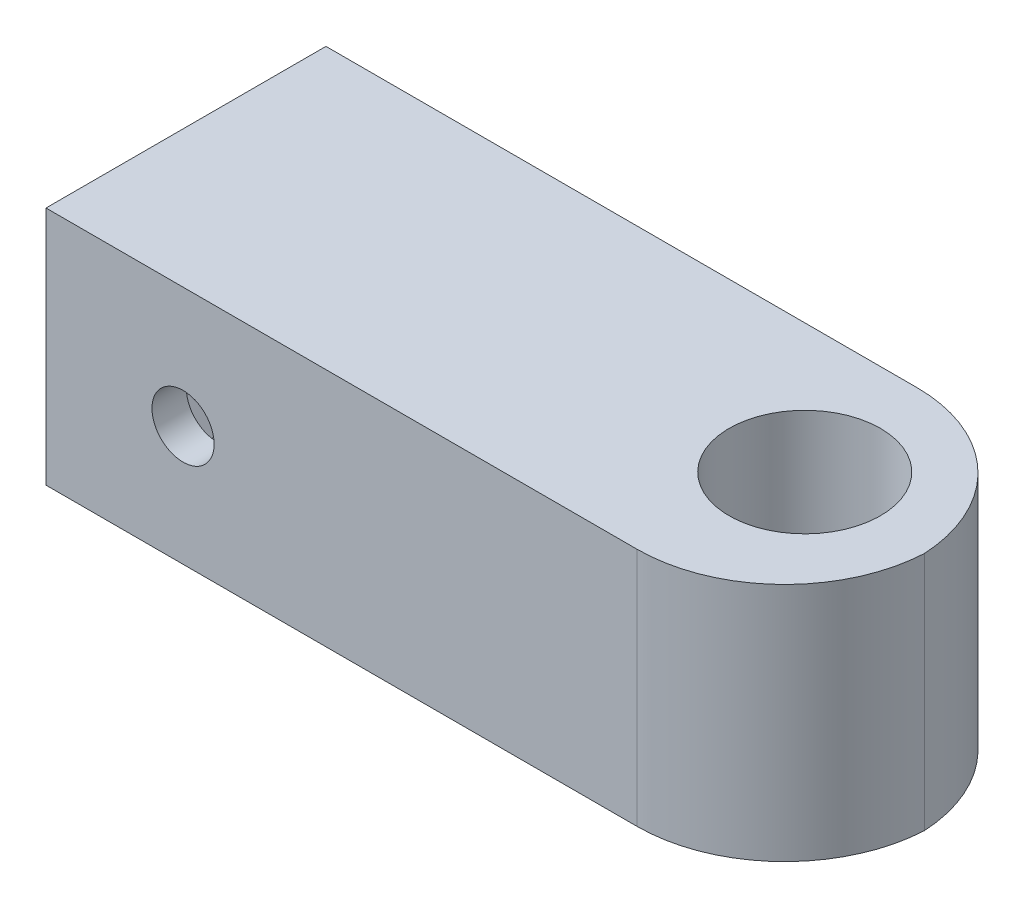
ISO-10303-21;
HEADER;
FILE_DESCRIPTION(('STEP AP214'),'2;1');
FILE_NAME('part.step','',(''),(''),'','','');
FILE_SCHEMA(('AUTOMOTIVE_DESIGN { 1 0 10303 214 1 1 1 1 }'));
ENDSEC;
DATA;
#1=APPLICATION_CONTEXT('core data for automotive mechanical design processes');
#2=APPLICATION_PROTOCOL_DEFINITION('international standard','automotive_design',2000,#1);
#3=PRODUCT_CONTEXT('',#1,'mechanical');
#4=PRODUCT('Part','Part','',(#3));
#5=PRODUCT_RELATED_PRODUCT_CATEGORY('part','',(#4));
#6=PRODUCT_DEFINITION_FORMATION('','',#4);
#7=PRODUCT_DEFINITION_CONTEXT('part definition',#1,'design');
#8=PRODUCT_DEFINITION('design','',#6,#7);
#9=PRODUCT_DEFINITION_SHAPE('','',#8);
#10=(LENGTH_UNIT() NAMED_UNIT(*) SI_UNIT(.MILLI.,.METRE.));
#11=(NAMED_UNIT(*) PLANE_ANGLE_UNIT() SI_UNIT($,.RADIAN.));
#12=(NAMED_UNIT(*) SI_UNIT($,.STERADIAN.) SOLID_ANGLE_UNIT());
#13=UNCERTAINTY_MEASURE_WITH_UNIT(LENGTH_MEASURE(1.E-05),#10,'distance_accuracy_value','');
#14=(GEOMETRIC_REPRESENTATION_CONTEXT(3) GLOBAL_UNCERTAINTY_ASSIGNED_CONTEXT((#13)) GLOBAL_UNIT_ASSIGNED_CONTEXT((#10,
#11,#12)) REPRESENTATION_CONTEXT('',''));
#15=CARTESIAN_POINT('',(0.,0.,0.));
#16=DIRECTION('',(0.,0.,1.));
#17=DIRECTION('',(1.,0.,0.));
#18=AXIS2_PLACEMENT_3D('',#15,#16,#17);
#19=CARTESIAN_POINT('',(0.,13.,0.));
#20=DIRECTION('',(0.,1.,0.));
#21=DIRECTION('',(0.,0.,1.));
#22=AXIS2_PLACEMENT_3D('',#19,#20,#21);
#23=PLANE('',#22);
#24=CARTESIAN_POINT('',(12.,13.,0.161034979478818));
#25=DIRECTION('',(0.,1.,0.));
#26=DIRECTION('',(0.,0.,1.));
#27=AXIS2_PLACEMENT_3D('',#24,#25,#26);
#28=CIRCLE('',#27,8.);
#29=CARTESIAN_POINT('',(12.,13.,8.16103497947882));
#30=VERTEX_POINT('',#29);
#31=CARTESIAN_POINT('',(19.9889945815219,13.,0.580517489739392));
#32=VERTEX_POINT('',#31);
#33=EDGE_CURVE('E52',#30,#32,#28,.T.);
#34=ORIENTED_EDGE('',*,*,#33,.T.);
#35=CARTESIAN_POINT('',(12.,13.,0.999999999999999));
#36=DIRECTION('',(0.,1.,0.));
#37=DIRECTION('',(0.,0.,1.));
#38=AXIS2_PLACEMENT_3D('',#35,#36,#37);
#39=CIRCLE('',#38,8.);
#40=CARTESIAN_POINT('',(12.,13.,-7.));
#41=VERTEX_POINT('',#40);
#42=EDGE_CURVE('E45',#32,#41,#39,.T.);
#43=ORIENTED_EDGE('',*,*,#42,.T.);
#44=DIRECTION('',(-1.,0.,0.));
#45=VECTOR('',#44,1.);
#46=CARTESIAN_POINT('',(20.,13.,-7.));
#47=LINE('',#46,#45);
#48=CARTESIAN_POINT('',(-20.,13.,-7.));
#49=VERTEX_POINT('',#48);
#50=EDGE_CURVE('E244',#41,#49,#47,.T.);
#51=ORIENTED_EDGE('',*,*,#50,.T.);
#52=DIRECTION('',(0.,0.,1.));
#53=VECTOR('',#52,1.);
#54=CARTESIAN_POINT('',(-20.,13.,5.));
#55=LINE('',#54,#53);
#56=CARTESIAN_POINT('',(-20.,13.,8.16103497947882));
#57=VERTEX_POINT('',#56);
#58=EDGE_CURVE('E246',#49,#57,#55,.T.);
#59=ORIENTED_EDGE('',*,*,#58,.T.);
#60=DIRECTION('',(1.,0.,0.));
#61=VECTOR('',#60,1.);
#62=CARTESIAN_POINT('',(-20.,13.,8.16103497947882));
#63=LINE('',#62,#61);
#64=EDGE_CURVE('E249',#57,#30,#63,.T.);
#65=ORIENTED_EDGE('',*,*,#64,.T.);
#66=EDGE_LOOP('',(#34,#43,#51,#59,#65));
#67=FACE_BOUND('',#66,.T.);
#68=CARTESIAN_POINT('',(12.9305740964565,13.,0.));
#69=DIRECTION('',(0.,1.,0.));
#70=DIRECTION('',(0.,0.,1.));
#71=AXIS2_PLACEMENT_3D('',#68,#69,#70);
#72=CIRCLE('',#71,4.1);
#73=CARTESIAN_POINT('',(12.9305740964565,13.,-4.1));
#74=VERTEX_POINT('',#73);
#75=EDGE_CURVE('E238',#74,#74,#72,.T.);
#76=ORIENTED_EDGE('',*,*,#75,.F.);
#77=EDGE_LOOP('',(#76));
#78=FACE_BOUND('',#77,.T.);
#79=ADVANCED_FACE('F36',(#67,#78),#23,.T.);
#80=CARTESIAN_POINT('',(0.,0.,0.));
#81=DIRECTION('',(0.,1.,0.));
#82=DIRECTION('',(0.,0.,1.));
#83=AXIS2_PLACEMENT_3D('',#80,#81,#82);
#84=PLANE('',#83);
#85=DIRECTION('',(-1.,0.,0.));
#86=VECTOR('',#85,1.);
#87=CARTESIAN_POINT('',(20.,0.,-7.));
#88=LINE('',#87,#86);
#89=CARTESIAN_POINT('',(12.,0.,-7.));
#90=VERTEX_POINT('',#89);
#91=CARTESIAN_POINT('',(-20.,0.,-7.));
#92=VERTEX_POINT('',#91);
#93=EDGE_CURVE('E241',#90,#92,#88,.T.);
#94=ORIENTED_EDGE('',*,*,#93,.F.);
#95=CARTESIAN_POINT('',(12.,0.,0.999999999999999));
#96=DIRECTION('',(0.,1.,0.));
#97=DIRECTION('',(0.,0.,1.));
#98=AXIS2_PLACEMENT_3D('',#95,#96,#97);
#99=CIRCLE('',#98,8.);
#100=CARTESIAN_POINT('',(19.9889945815219,0.,0.580517489739392));
#101=VERTEX_POINT('',#100);
#102=EDGE_CURVE('E266',#90,#101,#99,.F.);
#103=ORIENTED_EDGE('',*,*,#102,.T.);
#104=CARTESIAN_POINT('',(12.,0.,0.161034979478818));
#105=DIRECTION('',(0.,1.,0.));
#106=DIRECTION('',(0.,0.,1.));
#107=AXIS2_PLACEMENT_3D('',#104,#105,#106);
#108=CIRCLE('',#107,8.);
#109=CARTESIAN_POINT('',(12.,0.,8.16103497947882));
#110=VERTEX_POINT('',#109);
#111=EDGE_CURVE('E264',#101,#110,#108,.F.);
#112=ORIENTED_EDGE('',*,*,#111,.T.);
#113=DIRECTION('',(1.,0.,0.));
#114=VECTOR('',#113,1.);
#115=CARTESIAN_POINT('',(-20.,0.,8.16103497947882));
#116=LINE('',#115,#114);
#117=CARTESIAN_POINT('',(-20.,0.,8.16103497947882));
#118=VERTEX_POINT('',#117);
#119=EDGE_CURVE('E247',#118,#110,#116,.T.);
#120=ORIENTED_EDGE('',*,*,#119,.F.);
#121=DIRECTION('',(0.,0.,1.));
#122=VECTOR('',#121,1.);
#123=CARTESIAN_POINT('',(-20.,0.,5.));
#124=LINE('',#123,#122);
#125=EDGE_CURVE('E253',#92,#118,#124,.T.);
#126=ORIENTED_EDGE('',*,*,#125,.F.);
#127=EDGE_LOOP('',(#94,#103,#112,#120,#126));
#128=FACE_BOUND('',#127,.T.);
#129=CARTESIAN_POINT('',(12.9305740964565,0.,0.));
#130=DIRECTION('',(0.,1.,0.));
#131=DIRECTION('',(0.,0.,1.));
#132=AXIS2_PLACEMENT_3D('',#129,#130,#131);
#133=CIRCLE('',#132,4.1);
#134=CARTESIAN_POINT('',(12.9305740964565,0.,-4.1));
#135=VERTEX_POINT('',#134);
#136=EDGE_CURVE('E231',#135,#135,#133,.T.);
#137=ORIENTED_EDGE('',*,*,#136,.T.);
#138=EDGE_LOOP('',(#137));
#139=FACE_BOUND('',#138,.T.);
#140=ADVANCED_FACE('F283',(#128,#139),#84,.F.);
#141=CARTESIAN_POINT('',(20.,13.,-7.));
#142=DIRECTION('',(0.,0.,1.));
#143=DIRECTION('',(1.,0.,0.));
#144=AXIS2_PLACEMENT_3D('',#141,#142,#143);
#145=PLANE('',#144);
#146=ORIENTED_EDGE('',*,*,#50,.F.);
#147=DIRECTION('',(0.,-1.,0.));
#148=VECTOR('',#147,1.);
#149=CARTESIAN_POINT('',(12.,13.,-7.));
#150=LINE('',#149,#148);
#151=EDGE_CURVE('E261',#41,#90,#150,.T.);
#152=ORIENTED_EDGE('',*,*,#151,.T.);
#153=ORIENTED_EDGE('',*,*,#93,.T.);
#154=DIRECTION('',(0.,-1.,0.));
#155=VECTOR('',#154,1.);
#156=CARTESIAN_POINT('',(-20.,13.,-7.));
#157=LINE('',#156,#155);
#158=EDGE_CURVE('E258',#49,#92,#157,.T.);
#159=ORIENTED_EDGE('',*,*,#158,.F.);
#160=EDGE_LOOP('',(#146,#152,#153,#159));
#161=FACE_BOUND('',#160,.T.);
#162=ADVANCED_FACE('F277',(#161),#145,.F.);
#163=CARTESIAN_POINT('',(-20.,13.,5.));
#164=DIRECTION('',(1.,0.,0.));
#165=DIRECTION('',(0.,0.,-1.));
#166=AXIS2_PLACEMENT_3D('',#163,#164,#165);
#167=PLANE('',#166);
#168=DIRECTION('',(0.,0.,1.));
#169=VECTOR('',#168,1.);
#170=CARTESIAN_POINT('',(-20.,3.,3.5));
#171=LINE('',#170,#169);
#172=CARTESIAN_POINT('',(-20.,3.,-3.5));
#173=VERTEX_POINT('',#172);
#174=CARTESIAN_POINT('',(-20.,3.,3.5));
#175=VERTEX_POINT('',#174);
#176=EDGE_CURVE('E221',#173,#175,#171,.T.);
#177=ORIENTED_EDGE('',*,*,#176,.F.);
#178=DIRECTION('',(0.,-1.,0.));
#179=VECTOR('',#178,1.);
#180=CARTESIAN_POINT('',(-20.,3.,-3.5));
#181=LINE('',#180,#179);
#182=CARTESIAN_POINT('',(-20.,10.,-3.5));
#183=VERTEX_POINT('',#182);
#184=EDGE_CURVE('E198',#183,#173,#181,.T.);
#185=ORIENTED_EDGE('',*,*,#184,.F.);
#186=DIRECTION('',(0.,0.,-1.));
#187=VECTOR('',#186,1.);
#188=CARTESIAN_POINT('',(-20.,10.,3.5));
#189=LINE('',#188,#187);
#190=CARTESIAN_POINT('',(-20.,10.,3.5));
#191=VERTEX_POINT('',#190);
#192=EDGE_CURVE('E210',#191,#183,#189,.T.);
#193=ORIENTED_EDGE('',*,*,#192,.F.);
#194=DIRECTION('',(0.,1.,0.));
#195=VECTOR('',#194,1.);
#196=CARTESIAN_POINT('',(-20.,3.,3.5));
#197=LINE('',#196,#195);
#198=EDGE_CURVE('E224',#175,#191,#197,.T.);
#199=ORIENTED_EDGE('',*,*,#198,.F.);
#200=EDGE_LOOP('',(#177,#185,#193,#199));
#201=FACE_BOUND('',#200,.T.);
#202=ORIENTED_EDGE('',*,*,#125,.T.);
#203=DIRECTION('',(0.,-1.,0.));
#204=VECTOR('',#203,1.);
#205=CARTESIAN_POINT('',(-20.,13.,8.16103497947882));
#206=LINE('',#205,#204);
#207=EDGE_CURVE('E251',#57,#118,#206,.T.);
#208=ORIENTED_EDGE('',*,*,#207,.F.);
#209=ORIENTED_EDGE('',*,*,#58,.F.);
#210=ORIENTED_EDGE('',*,*,#158,.T.);
#211=EDGE_LOOP('',(#202,#208,#209,#210));
#212=FACE_BOUND('',#211,.T.);
#213=ADVANCED_FACE('F318',(#201,#212),#167,.F.);
#214=CARTESIAN_POINT('',(-20.,13.,8.16103497947882));
#215=DIRECTION('',(0.,0.,-1.));
#216=DIRECTION('',(-1.,0.,0.));
#217=AXIS2_PLACEMENT_3D('',#214,#215,#216);
#218=PLANE('',#217);
#219=CARTESIAN_POINT('',(-12.5774987078967,6.47590517488906,8.16103497947882));
#220=DIRECTION('',(0.,0.,-1.));
#221=DIRECTION('',(-1.,0.,0.));
#222=AXIS2_PLACEMENT_3D('',#219,#220,#221);
#223=CIRCLE('',#222,1.68366195753648);
#224=CARTESIAN_POINT('',(-14.2611606654332,6.47590517488906,8.16103497947882));
#225=VERTEX_POINT('',#224);
#226=EDGE_CURVE('E175',#225,#225,#223,.T.);
#227=ORIENTED_EDGE('',*,*,#226,.T.);
#228=EDGE_LOOP('',(#227));
#229=FACE_BOUND('',#228,.T.);
#230=ORIENTED_EDGE('',*,*,#119,.T.);
#231=DIRECTION('',(0.,-1.,0.));
#232=VECTOR('',#231,1.);
#233=CARTESIAN_POINT('',(12.,13.,8.16103497947882));
#234=LINE('',#233,#232);
#235=EDGE_CURVE('E11',#110,#30,#234,.F.);
#236=ORIENTED_EDGE('',*,*,#235,.T.);
#237=ORIENTED_EDGE('',*,*,#64,.F.);
#238=ORIENTED_EDGE('',*,*,#207,.T.);
#239=EDGE_LOOP('',(#230,#236,#237,#238));
#240=FACE_BOUND('',#239,.T.);
#241=ADVANCED_FACE('F295',(#229,#240),#218,.F.);
#242=CARTESIAN_POINT('',(12.9305740964565,13.,0.));
#243=DIRECTION('',(0.,-1.,0.));
#244=DIRECTION('',(0.,0.,-1.));
#245=AXIS2_PLACEMENT_3D('',#242,#243,#244);
#246=CYLINDRICAL_SURFACE('',#245,4.1);
#247=CARTESIAN_POINT('',(12.9305740964565,13.,-4.1));
#248=CARTESIAN_POINT('',(12.9305740964565,12.8645833333333,-4.1));
#249=CARTESIAN_POINT('',(12.9305740964565,12.7291666666667,-4.1));
#250=CARTESIAN_POINT('',(12.9305740964565,12.4583333333333,-4.1));
#251=CARTESIAN_POINT('',(12.9305740964565,12.3229166666667,-4.1));
#252=CARTESIAN_POINT('',(12.9305740964565,12.0520833333333,-4.1));
#253=CARTESIAN_POINT('',(12.9305740964565,11.9166666666667,-4.1));
#254=CARTESIAN_POINT('',(12.9305740964565,11.6458333333333,-4.1));
#255=CARTESIAN_POINT('',(12.9305740964565,11.5104166666667,-4.1));
#256=CARTESIAN_POINT('',(12.9305740964565,11.2395833333333,-4.1));
#257=CARTESIAN_POINT('',(12.9305740964565,11.1041666666667,-4.1));
#258=CARTESIAN_POINT('',(12.9305740964565,10.8333333333333,-4.1));
#259=CARTESIAN_POINT('',(12.9305740964565,10.6979166666667,-4.1));
#260=CARTESIAN_POINT('',(12.9305740964565,10.4270833333333,-4.1));
#261=CARTESIAN_POINT('',(12.9305740964565,10.2916666666667,-4.1));
#262=CARTESIAN_POINT('',(12.9305740964565,10.0208333333333,-4.1));
#263=CARTESIAN_POINT('',(12.9305740964565,9.88541666666667,-4.1));
#264=CARTESIAN_POINT('',(12.9305740964565,9.61458333333333,-4.1));
#265=CARTESIAN_POINT('',(12.9305740964565,9.47916666666667,-4.1));
#266=CARTESIAN_POINT('',(12.9305740964565,9.20833333333333,-4.1));
#267=CARTESIAN_POINT('',(12.9305740964565,9.07291666666667,-4.1));
#268=CARTESIAN_POINT('',(12.9305740964565,8.80208333333333,-4.1));
#269=CARTESIAN_POINT('',(12.9305740964565,8.66666666666667,-4.1));
#270=CARTESIAN_POINT('',(12.9305740964565,8.39583333333333,-4.1));
#271=CARTESIAN_POINT('',(12.9305740964565,8.26041666666667,-4.1));
#272=CARTESIAN_POINT('',(12.9305740964565,7.98958333333333,-4.1));
#273=CARTESIAN_POINT('',(12.9305740964565,7.85416666666667,-4.1));
#274=CARTESIAN_POINT('',(12.9305740964565,7.58333333333333,-4.1));
#275=CARTESIAN_POINT('',(12.9305740964565,7.44791666666667,-4.1));
#276=CARTESIAN_POINT('',(12.9305740964565,7.17708333333333,-4.1));
#277=CARTESIAN_POINT('',(12.9305740964565,7.04166666666667,-4.1));
#278=CARTESIAN_POINT('',(12.9305740964565,6.77083333333333,-4.1));
#279=CARTESIAN_POINT('',(12.9305740964565,6.63541666666667,-4.1));
#280=CARTESIAN_POINT('',(12.9305740964565,6.36458333333333,-4.1));
#281=CARTESIAN_POINT('',(12.9305740964565,6.22916666666667,-4.1));
#282=CARTESIAN_POINT('',(12.9305740964565,5.95833333333333,-4.1));
#283=CARTESIAN_POINT('',(12.9305740964565,5.82291666666667,-4.1));
#284=CARTESIAN_POINT('',(12.9305740964565,5.55208333333333,-4.1));
#285=CARTESIAN_POINT('',(12.9305740964565,5.41666666666667,-4.1));
#286=CARTESIAN_POINT('',(12.9305740964565,5.14583333333333,-4.1));
#287=CARTESIAN_POINT('',(12.9305740964565,5.01041666666667,-4.1));
#288=CARTESIAN_POINT('',(12.9305740964565,4.73958333333333,-4.1));
#289=CARTESIAN_POINT('',(12.9305740964565,4.60416666666667,-4.1));
#290=CARTESIAN_POINT('',(12.9305740964565,4.33333333333333,-4.1));
#291=CARTESIAN_POINT('',(12.9305740964565,4.19791666666667,-4.1));
#292=CARTESIAN_POINT('',(12.9305740964565,3.92708333333333,-4.1));
#293=CARTESIAN_POINT('',(12.9305740964565,3.79166666666667,-4.1));
#294=CARTESIAN_POINT('',(12.9305740964565,3.52083333333333,-4.1));
#295=CARTESIAN_POINT('',(12.9305740964565,3.38541666666667,-4.1));
#296=CARTESIAN_POINT('',(12.9305740964565,3.11458333333333,-4.1));
#297=CARTESIAN_POINT('',(12.9305740964565,2.97916666666667,-4.1));
#298=CARTESIAN_POINT('',(12.9305740964565,2.70833333333333,-4.1));
#299=CARTESIAN_POINT('',(12.9305740964565,2.57291666666667,-4.1));
#300=CARTESIAN_POINT('',(12.9305740964565,2.30208333333333,-4.1));
#301=CARTESIAN_POINT('',(12.9305740964565,2.16666666666667,-4.1));
#302=CARTESIAN_POINT('',(12.9305740964565,1.89583333333333,-4.1));
#303=CARTESIAN_POINT('',(12.9305740964565,1.76041666666667,-4.1));
#304=CARTESIAN_POINT('',(12.9305740964565,1.48958333333333,-4.1));
#305=CARTESIAN_POINT('',(12.9305740964565,1.35416666666667,-4.1));
#306=CARTESIAN_POINT('',(12.9305740964565,1.08333333333333,-4.1));
#307=CARTESIAN_POINT('',(12.9305740964565,0.947916666666667,-4.1));
#308=CARTESIAN_POINT('',(12.9305740964565,0.677083333333334,-4.1));
#309=CARTESIAN_POINT('',(12.9305740964565,0.541666666666667,-4.1));
#310=CARTESIAN_POINT('',(12.9305740964565,0.270833333333334,-4.1));
#311=CARTESIAN_POINT('',(12.9305740964565,0.135416666666667,-4.1));
#312=CARTESIAN_POINT('',(12.9305740964565,0.,-4.1));
#313=B_SPLINE_CURVE_WITH_KNOTS('',3,(#247,#248,#249,#250,#251,#252,#253,#254,#255,#256,#257,
#258,#259,#260,#261,#262,#263,#264,#265,#266,#267,#268,#269,#270,#271,#272,#273,#274,#275,#276,
#277,#278,#279,#280,#281,#282,#283,#284,#285,#286,#287,#288,#289,#290,#291,#292,#293,#294,#295,
#296,#297,#298,#299,#300,#301,#302,#303,#304,#305,#306,#307,#308,#309,#310,#311,#312),
.UNSPECIFIED.,.F.,.F.,(4,2,2,2,2,2,2,2,2,2,2,2,2,2,2,2,2,2,2,2,2,2,2,2,2,2,2,2,2,2,2,2,4),(0.,
0.406249999999999,0.812499999999999,1.21875,1.625,2.03125,2.4375,2.84375,3.25,3.65625,4.0625,
4.46875,4.875,5.28125,5.6875,6.09375,6.5,6.90625,7.3125,7.71875,8.125,8.53125,8.9375,9.34375,
9.75,10.15625,10.5625,10.96875,11.375,11.78125,12.1875,12.59375,13.),.UNSPECIFIED.);
#314=EDGE_CURVE('BSEAM313',#74,#135,#313,.T.);
#315=ORIENTED_EDGE('',*,*,#75,.T.);
#316=ORIENTED_EDGE('',*,*,#136,.F.);
#317=ORIENTED_EDGE('',*,*,#314,.T.);
#318=ORIENTED_EDGE('',*,*,#314,.F.);
#319=EDGE_LOOP('',(#315,#317,#316,#318));
#320=FACE_BOUND('',#319,.T.);
#321=ADVANCED_FACE('F313',(#320),#246,.F.);
#322=CARTESIAN_POINT('',(6.00000000000002,3.,-3.5));
#323=DIRECTION('',(0.,0.,-1.));
#324=DIRECTION('',(-1.,0.,0.));
#325=AXIS2_PLACEMENT_3D('',#322,#323,#324);
#326=PLANE('',#325);
#327=ORIENTED_EDGE('',*,*,#184,.T.);
#328=DIRECTION('',(-1.,0.,0.));
#329=VECTOR('',#328,1.);
#330=CARTESIAN_POINT('',(6.00000000000002,3.,-3.5));
#331=LINE('',#330,#329);
#332=CARTESIAN_POINT('',(6.00000000000002,3.,-3.5));
#333=VERTEX_POINT('',#332);
#334=EDGE_CURVE('E219',#333,#173,#331,.T.);
#335=ORIENTED_EDGE('',*,*,#334,.F.);
#336=DIRECTION('',(0.,-1.,0.));
#337=VECTOR('',#336,1.);
#338=CARTESIAN_POINT('',(6.00000000000002,3.,-3.5));
#339=LINE('',#338,#337);
#340=CARTESIAN_POINT('',(6.00000000000002,10.,-3.5));
#341=VERTEX_POINT('',#340);
#342=EDGE_CURVE('E206',#341,#333,#339,.T.);
#343=ORIENTED_EDGE('',*,*,#342,.F.);
#344=DIRECTION('',(-1.,0.,0.));
#345=VECTOR('',#344,1.);
#346=CARTESIAN_POINT('',(6.00000000000002,10.,-3.5));
#347=LINE('',#346,#345);
#348=EDGE_CURVE('E229',#341,#183,#347,.T.);
#349=ORIENTED_EDGE('',*,*,#348,.T.);
#350=EDGE_LOOP('',(#327,#335,#343,#349));
#351=FACE_BOUND('',#350,.T.);
#352=ADVANCED_FACE('F462',(#351),#326,.F.);
#353=CARTESIAN_POINT('',(6.00000000000002,10.,3.5));
#354=DIRECTION('',(0.,1.,0.));
#355=DIRECTION('',(0.,0.,1.));
#356=AXIS2_PLACEMENT_3D('',#353,#354,#355);
#357=PLANE('',#356);
#358=ORIENTED_EDGE('',*,*,#192,.T.);
#359=ORIENTED_EDGE('',*,*,#348,.F.);
#360=DIRECTION('',(0.,0.,-1.));
#361=VECTOR('',#360,1.);
#362=CARTESIAN_POINT('',(6.00000000000002,10.,3.5));
#363=LINE('',#362,#361);
#364=CARTESIAN_POINT('',(6.00000000000002,10.,3.5));
#365=VERTEX_POINT('',#364);
#366=EDGE_CURVE('E216',#365,#341,#363,.T.);
#367=ORIENTED_EDGE('',*,*,#366,.F.);
#368=DIRECTION('',(-1.,0.,0.));
#369=VECTOR('',#368,1.);
#370=CARTESIAN_POINT('',(6.00000000000002,10.,3.5));
#371=LINE('',#370,#369);
#372=EDGE_CURVE('E232',#365,#191,#371,.T.);
#373=ORIENTED_EDGE('',*,*,#372,.T.);
#374=EDGE_LOOP('',(#358,#359,#367,#373));
#375=FACE_BOUND('',#374,.T.);
#376=ADVANCED_FACE('F436',(#375),#357,.F.);
#377=CARTESIAN_POINT('',(6.00000000000002,3.,3.5));
#378=DIRECTION('',(0.,0.,1.));
#379=DIRECTION('',(1.,0.,0.));
#380=AXIS2_PLACEMENT_3D('',#377,#378,#379);
#381=PLANE('',#380);
#382=DIRECTION('',(-0.499999999999998,-0.86602540378444,0.));
#383=VECTOR('',#382,1.);
#384=CARTESIAN_POINT('',(-8.88245698508306,6.47590517488908,3.5));
#385=LINE('',#384,#383);
#386=CARTESIAN_POINT('',(-8.88245698508306,6.47590517488908,3.5));
#387=VERTEX_POINT('',#386);
#388=CARTESIAN_POINT('',(-10.7299778464899,3.27590517488907,3.5));
#389=VERTEX_POINT('',#388);
#390=EDGE_CURVE('E186',#387,#389,#385,.T.);
#391=ORIENTED_EDGE('',*,*,#390,.F.);
#392=DIRECTION('',(0.500000000000002,-0.866025403784438,0.));
#393=VECTOR('',#392,1.);
#394=CARTESIAN_POINT('',(-10.7299778464899,9.67590517488908,3.5));
#395=LINE('',#394,#393);
#396=CARTESIAN_POINT('',(-10.7299778464899,9.67590517488908,3.5));
#397=VERTEX_POINT('',#396);
#398=EDGE_CURVE('E151',#397,#387,#395,.T.);
#399=ORIENTED_EDGE('',*,*,#398,.F.);
#400=DIRECTION('',(1.,0.,0.));
#401=VECTOR('',#400,1.);
#402=CARTESIAN_POINT('',(-14.4250195693035,9.67590517488907,3.5));
#403=LINE('',#402,#401);
#404=CARTESIAN_POINT('',(-14.4250195693035,9.67590517488907,3.5));
#405=VERTEX_POINT('',#404);
#406=EDGE_CURVE('E169',#405,#397,#403,.T.);
#407=ORIENTED_EDGE('',*,*,#406,.F.);
#408=DIRECTION('',(0.499999999999997,0.86602540378444,0.));
#409=VECTOR('',#408,1.);
#410=CARTESIAN_POINT('',(-16.2725404307103,6.47590517488906,3.5));
#411=LINE('',#410,#409);
#412=CARTESIAN_POINT('',(-16.2725404307103,6.47590517488906,3.5));
#413=VERTEX_POINT('',#412);
#414=EDGE_CURVE('E172',#413,#405,#411,.T.);
#415=ORIENTED_EDGE('',*,*,#414,.F.);
#416=DIRECTION('',(-0.500000000000002,0.866025403784438,0.));
#417=VECTOR('',#416,1.);
#418=CARTESIAN_POINT('',(-14.4250195693035,3.27590517488906,3.5));
#419=LINE('',#418,#417);
#420=CARTESIAN_POINT('',(-14.4250195693035,3.27590517488906,3.5));
#421=VERTEX_POINT('',#420);
#422=EDGE_CURVE('E191',#421,#413,#419,.T.);
#423=ORIENTED_EDGE('',*,*,#422,.F.);
#424=DIRECTION('',(-1.,0.,0.));
#425=VECTOR('',#424,1.);
#426=CARTESIAN_POINT('',(-10.7299778464899,3.27590517488907,3.5));
#427=LINE('',#426,#425);
#428=EDGE_CURVE('E188',#389,#421,#427,.T.);
#429=ORIENTED_EDGE('',*,*,#428,.F.);
#430=EDGE_LOOP('',(#391,#399,#407,#415,#423,#429));
#431=FACE_BOUND('',#430,.T.);
#432=ORIENTED_EDGE('',*,*,#198,.T.);
#433=ORIENTED_EDGE('',*,*,#372,.F.);
#434=DIRECTION('',(0.,1.,0.));
#435=VECTOR('',#434,1.);
#436=CARTESIAN_POINT('',(6.00000000000002,3.,3.5));
#437=LINE('',#436,#435);
#438=CARTESIAN_POINT('',(6.00000000000002,3.,3.5));
#439=VERTEX_POINT('',#438);
#440=EDGE_CURVE('E213',#439,#365,#437,.T.);
#441=ORIENTED_EDGE('',*,*,#440,.F.);
#442=DIRECTION('',(-1.,0.,0.));
#443=VECTOR('',#442,1.);
#444=CARTESIAN_POINT('',(6.00000000000002,3.,3.5));
#445=LINE('',#444,#443);
#446=EDGE_CURVE('E234',#439,#175,#445,.T.);
#447=ORIENTED_EDGE('',*,*,#446,.T.);
#448=EDGE_LOOP('',(#432,#433,#441,#447));
#449=FACE_BOUND('',#448,.T.);
#450=ADVANCED_FACE('F430',(#431,#449),#381,.F.);
#451=CARTESIAN_POINT('',(6.00000000000002,3.,3.5));
#452=DIRECTION('',(0.,-1.,0.));
#453=DIRECTION('',(0.,0.,-1.));
#454=AXIS2_PLACEMENT_3D('',#451,#452,#453);
#455=PLANE('',#454);
#456=ORIENTED_EDGE('',*,*,#176,.T.);
#457=ORIENTED_EDGE('',*,*,#446,.F.);
#458=DIRECTION('',(0.,0.,1.));
#459=VECTOR('',#458,1.);
#460=CARTESIAN_POINT('',(6.00000000000002,3.,3.5));
#461=LINE('',#460,#459);
#462=EDGE_CURVE('E209',#333,#439,#461,.T.);
#463=ORIENTED_EDGE('',*,*,#462,.F.);
#464=ORIENTED_EDGE('',*,*,#334,.T.);
#465=EDGE_LOOP('',(#456,#457,#463,#464));
#466=FACE_BOUND('',#465,.T.);
#467=ADVANCED_FACE('F435',(#466),#455,.F.);
#468=CARTESIAN_POINT('',(6.00000000000002,0.,0.));
#469=DIRECTION('',(-1.,0.,0.));
#470=DIRECTION('',(0.,0.,1.));
#471=AXIS2_PLACEMENT_3D('',#468,#469,#470);
#472=PLANE('',#471);
#473=ORIENTED_EDGE('',*,*,#342,.T.);
#474=ORIENTED_EDGE('',*,*,#462,.T.);
#475=ORIENTED_EDGE('',*,*,#440,.T.);
#476=ORIENTED_EDGE('',*,*,#366,.T.);
#477=EDGE_LOOP('',(#473,#474,#475,#476));
#478=FACE_BOUND('',#477,.T.);
#479=ADVANCED_FACE('F423',(#478),#472,.T.);
#480=CARTESIAN_POINT('',(-10.7299778464899,9.67590517488908,6.3));
#481=DIRECTION('',(0.866025403784438,0.500000000000002,0.));
#482=DIRECTION('',(-0.500000000000002,0.866025403784438,0.));
#483=AXIS2_PLACEMENT_3D('',#480,#481,#482);
#484=PLANE('',#483);
#485=ORIENTED_EDGE('',*,*,#398,.T.);
#486=DIRECTION('',(0.,0.,-1.));
#487=VECTOR('',#486,1.);
#488=CARTESIAN_POINT('',(-8.88245698508306,6.47590517488908,6.3));
#489=LINE('',#488,#487);
#490=CARTESIAN_POINT('',(-8.88245698508306,6.47590517488908,6.3));
#491=VERTEX_POINT('',#490);
#492=EDGE_CURVE('E144',#491,#387,#489,.T.);
#493=ORIENTED_EDGE('',*,*,#492,.F.);
#494=DIRECTION('',(0.500000000000002,-0.866025403784438,0.));
#495=VECTOR('',#494,1.);
#496=CARTESIAN_POINT('',(-10.7299778464899,9.67590517488908,6.3));
#497=LINE('',#496,#495);
#498=CARTESIAN_POINT('',(-10.7299778464899,9.67590517488908,6.3));
#499=VERTEX_POINT('',#498);
#500=EDGE_CURVE('E148',#499,#491,#497,.T.);
#501=ORIENTED_EDGE('',*,*,#500,.F.);
#502=DIRECTION('',(0.,0.,-1.));
#503=VECTOR('',#502,1.);
#504=CARTESIAN_POINT('',(-10.7299778464899,9.67590517488908,6.3));
#505=LINE('',#504,#503);
#506=EDGE_CURVE('E196',#499,#397,#505,.T.);
#507=ORIENTED_EDGE('',*,*,#506,.T.);
#508=EDGE_LOOP('',(#485,#493,#501,#507));
#509=FACE_BOUND('',#508,.T.);
#510=ADVANCED_FACE('F146',(#509),#484,.F.);
#511=CARTESIAN_POINT('',(-14.4250195693035,9.67590517488907,6.3));
#512=DIRECTION('',(0.,1.,0.));
#513=DIRECTION('',(-1.,0.,0.));
#514=AXIS2_PLACEMENT_3D('',#511,#512,#513);
#515=PLANE('',#514);
#516=ORIENTED_EDGE('',*,*,#406,.T.);
#517=ORIENTED_EDGE('',*,*,#506,.F.);
#518=DIRECTION('',(1.,0.,0.));
#519=VECTOR('',#518,1.);
#520=CARTESIAN_POINT('',(-14.4250195693035,9.67590517488907,6.3));
#521=LINE('',#520,#519);
#522=CARTESIAN_POINT('',(-14.4250195693035,9.67590517488907,6.3));
#523=VERTEX_POINT('',#522);
#524=EDGE_CURVE('E156',#523,#499,#521,.T.);
#525=ORIENTED_EDGE('',*,*,#524,.F.);
#526=DIRECTION('',(0.,0.,-1.));
#527=VECTOR('',#526,1.);
#528=CARTESIAN_POINT('',(-14.4250195693035,9.67590517488907,6.3));
#529=LINE('',#528,#527);
#530=EDGE_CURVE('E199',#523,#405,#529,.T.);
#531=ORIENTED_EDGE('',*,*,#530,.T.);
#532=EDGE_LOOP('',(#516,#517,#525,#531));
#533=FACE_BOUND('',#532,.T.);
#534=ADVANCED_FACE('F404',(#533),#515,.F.);
#535=CARTESIAN_POINT('',(-16.2725404307103,6.47590517488906,6.3));
#536=DIRECTION('',(-0.86602540378444,0.499999999999998,0.));
#537=DIRECTION('',(-0.499999999999998,-0.86602540378444,0.));
#538=AXIS2_PLACEMENT_3D('',#535,#536,#537);
#539=PLANE('',#538);
#540=ORIENTED_EDGE('',*,*,#414,.T.);
#541=ORIENTED_EDGE('',*,*,#530,.F.);
#542=DIRECTION('',(0.499999999999997,0.86602540378444,0.));
#543=VECTOR('',#542,1.);
#544=CARTESIAN_POINT('',(-16.2725404307103,6.47590517488906,6.3));
#545=LINE('',#544,#543);
#546=CARTESIAN_POINT('',(-16.2725404307103,6.47590517488906,6.3));
#547=VERTEX_POINT('',#546);
#548=EDGE_CURVE('E182',#547,#523,#545,.T.);
#549=ORIENTED_EDGE('',*,*,#548,.F.);
#550=DIRECTION('',(0.,0.,-1.));
#551=VECTOR('',#550,1.);
#552=CARTESIAN_POINT('',(-16.2725404307103,6.47590517488906,6.3));
#553=LINE('',#552,#551);
#554=EDGE_CURVE('E201',#547,#413,#553,.T.);
#555=ORIENTED_EDGE('',*,*,#554,.T.);
#556=EDGE_LOOP('',(#540,#541,#549,#555));
#557=FACE_BOUND('',#556,.T.);
#558=ADVANCED_FACE('F394',(#557),#539,.F.);
#559=CARTESIAN_POINT('',(-14.4250195693035,3.27590517488906,6.3));
#560=DIRECTION('',(-0.866025403784438,-0.500000000000002,0.));
#561=DIRECTION('',(0.500000000000002,-0.866025403784438,0.));
#562=AXIS2_PLACEMENT_3D('',#559,#560,#561);
#563=PLANE('',#562);
#564=ORIENTED_EDGE('',*,*,#422,.T.);
#565=ORIENTED_EDGE('',*,*,#554,.F.);
#566=DIRECTION('',(-0.500000000000002,0.866025403784438,0.));
#567=VECTOR('',#566,1.);
#568=CARTESIAN_POINT('',(-14.4250195693035,3.27590517488906,6.3));
#569=LINE('',#568,#567);
#570=CARTESIAN_POINT('',(-14.4250195693035,3.27590517488906,6.3));
#571=VERTEX_POINT('',#570);
#572=EDGE_CURVE('E179',#571,#547,#569,.T.);
#573=ORIENTED_EDGE('',*,*,#572,.F.);
#574=DIRECTION('',(0.,0.,-1.));
#575=VECTOR('',#574,1.);
#576=CARTESIAN_POINT('',(-14.4250195693035,3.27590517488906,6.3));
#577=LINE('',#576,#575);
#578=EDGE_CURVE('E203',#571,#421,#577,.T.);
#579=ORIENTED_EDGE('',*,*,#578,.T.);
#580=EDGE_LOOP('',(#564,#565,#573,#579));
#581=FACE_BOUND('',#580,.T.);
#582=ADVANCED_FACE('F384',(#581),#563,.F.);
#583=CARTESIAN_POINT('',(-10.7299778464899,3.27590517488907,6.3));
#584=DIRECTION('',(0.,-1.,0.));
#585=DIRECTION('',(1.,0.,0.));
#586=AXIS2_PLACEMENT_3D('',#583,#584,#585);
#587=PLANE('',#586);
#588=ORIENTED_EDGE('',*,*,#428,.T.);
#589=ORIENTED_EDGE('',*,*,#578,.F.);
#590=DIRECTION('',(-1.,0.,0.));
#591=VECTOR('',#590,1.);
#592=CARTESIAN_POINT('',(-10.7299778464899,3.27590517488907,6.3));
#593=LINE('',#592,#591);
#594=CARTESIAN_POINT('',(-10.7299778464899,3.27590517488907,6.3));
#595=VERTEX_POINT('',#594);
#596=EDGE_CURVE('E164',#595,#571,#593,.T.);
#597=ORIENTED_EDGE('',*,*,#596,.F.);
#598=DIRECTION('',(0.,0.,-1.));
#599=VECTOR('',#598,1.);
#600=CARTESIAN_POINT('',(-10.7299778464899,3.27590517488907,6.3));
#601=LINE('',#600,#599);
#602=EDGE_CURVE('E155',#595,#389,#601,.T.);
#603=ORIENTED_EDGE('',*,*,#602,.T.);
#604=EDGE_LOOP('',(#588,#589,#597,#603));
#605=FACE_BOUND('',#604,.T.);
#606=ADVANCED_FACE('F375',(#605),#587,.F.);
#607=CARTESIAN_POINT('',(-8.88245698508306,6.47590517488908,6.3));
#608=DIRECTION('',(0.86602540378444,-0.499999999999998,0.));
#609=DIRECTION('',(0.499999999999998,0.86602540378444,0.));
#610=AXIS2_PLACEMENT_3D('',#607,#608,#609);
#611=PLANE('',#610);
#612=ORIENTED_EDGE('',*,*,#390,.T.);
#613=ORIENTED_EDGE('',*,*,#602,.F.);
#614=DIRECTION('',(-0.499999999999998,-0.86602540378444,0.));
#615=VECTOR('',#614,1.);
#616=CARTESIAN_POINT('',(-8.88245698508306,6.47590517488908,6.3));
#617=LINE('',#616,#615);
#618=EDGE_CURVE('E159',#491,#595,#617,.T.);
#619=ORIENTED_EDGE('',*,*,#618,.F.);
#620=ORIENTED_EDGE('',*,*,#492,.T.);
#621=EDGE_LOOP('',(#612,#613,#619,#620));
#622=FACE_BOUND('',#621,.T.);
#623=ADVANCED_FACE('F160',(#622),#611,.F.);
#624=CARTESIAN_POINT('',(0.,0.,6.3));
#625=DIRECTION('',(0.,0.,-1.));
#626=DIRECTION('',(-1.,0.,0.));
#627=AXIS2_PLACEMENT_3D('',#624,#625,#626);
#628=PLANE('',#627);
#629=CARTESIAN_POINT('',(-12.5774987078967,6.47590517488906,6.3));
#630=DIRECTION('',(0.,0.,-1.));
#631=DIRECTION('',(-1.,0.,0.));
#632=AXIS2_PLACEMENT_3D('',#629,#630,#631);
#633=CIRCLE('',#632,1.68366195753648);
#634=CARTESIAN_POINT('',(-14.2611606654332,6.47590517488906,6.3));
#635=VERTEX_POINT('',#634);
#636=EDGE_CURVE('E288',#635,#635,#633,.T.);
#637=ORIENTED_EDGE('',*,*,#636,.F.);
#638=EDGE_LOOP('',(#637));
#639=FACE_BOUND('',#638,.T.);
#640=ORIENTED_EDGE('',*,*,#500,.T.);
#641=ORIENTED_EDGE('',*,*,#618,.T.);
#642=ORIENTED_EDGE('',*,*,#596,.T.);
#643=ORIENTED_EDGE('',*,*,#572,.T.);
#644=ORIENTED_EDGE('',*,*,#548,.T.);
#645=ORIENTED_EDGE('',*,*,#524,.T.);
#646=EDGE_LOOP('',(#640,#641,#642,#643,#644,#645));
#647=FACE_BOUND('',#646,.T.);
#648=ADVANCED_FACE('F166',(#639,#647),#628,.T.);
#649=CARTESIAN_POINT('',(-12.5774987078967,6.47590517488906,9.1));
#650=DIRECTION('',(0.,0.,-1.));
#651=DIRECTION('',(-1.,0.,0.));
#652=AXIS2_PLACEMENT_3D('',#649,#650,#651);
#653=CYLINDRICAL_SURFACE('',#652,1.68366195753648);
#654=ORIENTED_EDGE('',*,*,#636,.T.);
#655=EDGE_LOOP('',(#654));
#656=FACE_BOUND('',#655,.T.);
#657=ORIENTED_EDGE('',*,*,#226,.F.);
#658=EDGE_LOOP('',(#657));
#659=FACE_BOUND('',#658,.T.);
#660=ADVANCED_FACE('F297',(#656,#659),#653,.F.);
#661=CARTESIAN_POINT('',(12.,13.,0.161034979478818));
#662=DIRECTION('',(0.,-1.,0.));
#663=DIRECTION('',(0.,0.,-1.));
#664=AXIS2_PLACEMENT_3D('',#661,#662,#663);
#665=CYLINDRICAL_SURFACE('',#664,8.);
#666=DIRECTION('',(0.,-1.,0.));
#667=VECTOR('',#666,1.);
#668=CARTESIAN_POINT('',(19.9889945815219,6.5,0.580517489739392));
#669=LINE('',#668,#667);
#670=EDGE_CURVE('E40',#32,#101,#669,.T.);
#671=ORIENTED_EDGE('',*,*,#670,.F.);
#672=ORIENTED_EDGE('',*,*,#33,.F.);
#673=ORIENTED_EDGE('',*,*,#235,.F.);
#674=ORIENTED_EDGE('',*,*,#111,.F.);
#675=EDGE_LOOP('',(#671,#672,#673,#674));
#676=FACE_BOUND('',#675,.T.);
#677=ADVANCED_FACE('F38',(#676),#665,.T.);
#678=CARTESIAN_POINT('',(12.,13.,0.999999999999999));
#679=DIRECTION('',(0.,-1.,0.));
#680=DIRECTION('',(0.,0.,-1.));
#681=AXIS2_PLACEMENT_3D('',#678,#679,#680);
#682=CYLINDRICAL_SURFACE('',#681,8.);
#683=ORIENTED_EDGE('',*,*,#42,.F.);
#684=ORIENTED_EDGE('',*,*,#670,.T.);
#685=ORIENTED_EDGE('',*,*,#102,.F.);
#686=ORIENTED_EDGE('',*,*,#151,.F.);
#687=EDGE_LOOP('',(#683,#684,#685,#686));
#688=FACE_BOUND('',#687,.T.);
#689=ADVANCED_FACE('F280',(#688),#682,.T.);
#690=CLOSED_SHELL('',(#79,#140,#162,#213,#241,#321,#352,#376,#450,#467,#479,#510,#534,#558,#582,
#606,#623,#648,#660,#677,#689));
#691=MANIFOLD_SOLID_BREP('B2',#690);
#692=ADVANCED_BREP_SHAPE_REPRESENTATION('',(#18,#691),#14);
#693=SHAPE_DEFINITION_REPRESENTATION(#9,#692);
ENDSEC;
END-ISO-10303-21;
